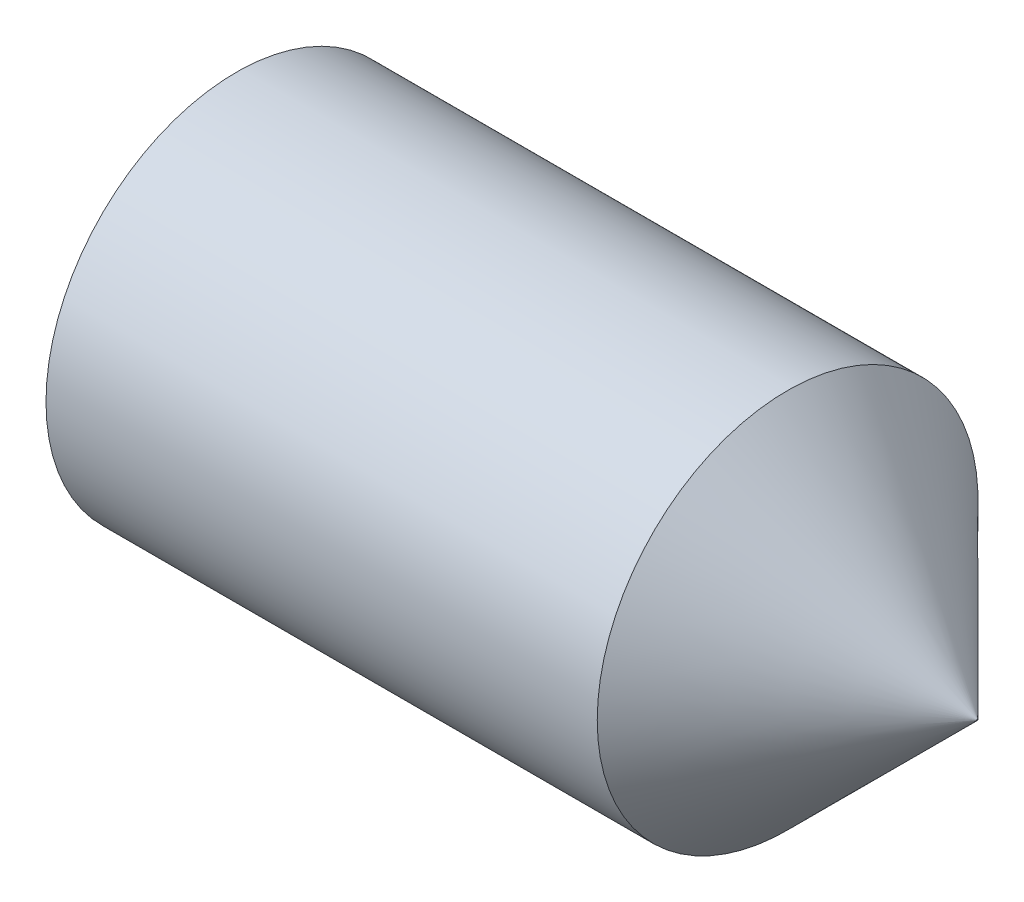
ISO-10303-21;
HEADER;
FILE_DESCRIPTION(('STEP AP214'),'2;1');
FILE_NAME('part.step','',(''),(''),'','','');
FILE_SCHEMA(('AUTOMOTIVE_DESIGN { 1 0 10303 214 1 1 1 1 }'));
ENDSEC;
DATA;
#1=APPLICATION_CONTEXT('core data for automotive mechanical design processes');
#2=APPLICATION_PROTOCOL_DEFINITION('international standard','automotive_design',2000,#1);
#3=PRODUCT_CONTEXT('',#1,'mechanical');
#4=PRODUCT('Part','Part','',(#3));
#5=PRODUCT_RELATED_PRODUCT_CATEGORY('part','',(#4));
#6=PRODUCT_DEFINITION_FORMATION('','',#4);
#7=PRODUCT_DEFINITION_CONTEXT('part definition',#1,'design');
#8=PRODUCT_DEFINITION('design','',#6,#7);
#9=PRODUCT_DEFINITION_SHAPE('','',#8);
#10=(LENGTH_UNIT() NAMED_UNIT(*) SI_UNIT(.MILLI.,.METRE.));
#11=(NAMED_UNIT(*) PLANE_ANGLE_UNIT() SI_UNIT($,.RADIAN.));
#12=(NAMED_UNIT(*) SI_UNIT($,.STERADIAN.) SOLID_ANGLE_UNIT());
#13=UNCERTAINTY_MEASURE_WITH_UNIT(LENGTH_MEASURE(1.E-05),#10,'distance_accuracy_value','');
#14=(GEOMETRIC_REPRESENTATION_CONTEXT(3) GLOBAL_UNCERTAINTY_ASSIGNED_CONTEXT((#13)) GLOBAL_UNIT_ASSIGNED_CONTEXT((#10,
#11,#12)) REPRESENTATION_CONTEXT('',''));
#15=CARTESIAN_POINT('',(0.,0.,0.));
#16=DIRECTION('',(0.,0.,1.));
#17=DIRECTION('',(1.,0.,0.));
#18=AXIS2_PLACEMENT_3D('',#15,#16,#17);
#19=CARTESIAN_POINT('',(0.,0.,0.));
#20=DIRECTION('',(-1.,0.,0.));
#21=DIRECTION('',(0.,0.,1.));
#22=AXIS2_PLACEMENT_3D('',#19,#20,#21);
#23=PLANE('',#22);
#24=CARTESIAN_POINT('',(0.,0.,0.));
#25=DIRECTION('',(-1.,0.,0.));
#26=DIRECTION('',(0.,0.,1.));
#27=AXIS2_PLACEMENT_3D('',#24,#25,#26);
#28=CIRCLE('',#27,1.2195);
#29=CARTESIAN_POINT('',(0.,0.,1.2195));
#30=VERTEX_POINT('',#29);
#31=EDGE_CURVE('E138',#30,#30,#28,.T.);
#32=ORIENTED_EDGE('',*,*,#31,.T.);
#33=EDGE_LOOP('',(#32));
#34=FACE_BOUND('',#33,.T.);
#35=DIRECTION('',(0.,0.,-1.));
#36=VECTOR('',#35,1.);
#37=CARTESIAN_POINT('',(0.,0.750000000000003,0.433012701892217));
#38=LINE('',#37,#36);
#39=CARTESIAN_POINT('',(0.,0.750000000000003,0.433012701892217));
#40=VERTEX_POINT('',#39);
#41=CARTESIAN_POINT('',(0.,0.750000000000003,-0.433012701892221));
#42=VERTEX_POINT('',#41);
#43=EDGE_CURVE('E129',#40,#42,#38,.T.);
#44=ORIENTED_EDGE('',*,*,#43,.F.);
#45=DIRECTION('',(0.,-0.866025403784438,0.5));
#46=VECTOR('',#45,1.);
#47=CARTESIAN_POINT('',(0.,0.750000000000003,0.433012701892217));
#48=LINE('',#47,#46);
#49=CARTESIAN_POINT('',(0.,0.,0.866025403784437));
#50=VERTEX_POINT('',#49);
#51=EDGE_CURVE('E51',#40,#50,#48,.T.);
#52=ORIENTED_EDGE('',*,*,#51,.T.);
#53=DIRECTION('',(0.,0.866025403784439,0.5));
#54=VECTOR('',#53,1.);
#55=CARTESIAN_POINT('',(0.,-0.749999999999996,0.433012701892218));
#56=LINE('',#55,#54);
#57=CARTESIAN_POINT('',(0.,-0.749999999999996,0.433012701892218));
#58=VERTEX_POINT('',#57);
#59=EDGE_CURVE('E120',#58,#50,#56,.T.);
#60=ORIENTED_EDGE('',*,*,#59,.F.);
#61=DIRECTION('',(0.,0.,-1.));
#62=VECTOR('',#61,1.);
#63=CARTESIAN_POINT('',(0.,-0.749999999999996,0.433012701892218));
#64=LINE('',#63,#62);
#65=CARTESIAN_POINT('',(0.,-0.749999999999996,-0.433012701892221));
#66=VERTEX_POINT('',#65);
#67=EDGE_CURVE('E123',#58,#66,#64,.T.);
#68=ORIENTED_EDGE('',*,*,#67,.T.);
#69=DIRECTION('',(0.,0.866025403784438,-0.500000000000001));
#70=VECTOR('',#69,1.);
#71=CARTESIAN_POINT('',(0.,-0.749999999999996,-0.433012701892221));
#72=LINE('',#71,#70);
#73=CARTESIAN_POINT('',(0.,0.,-0.866025403784441));
#74=VERTEX_POINT('',#73);
#75=EDGE_CURVE('E126',#66,#74,#72,.T.);
#76=ORIENTED_EDGE('',*,*,#75,.T.);
#77=DIRECTION('',(0.,-0.866025403784438,-0.5));
#78=VECTOR('',#77,1.);
#79=CARTESIAN_POINT('',(0.,0.750000000000003,-0.433012701892221));
#80=LINE('',#79,#78);
#81=EDGE_CURVE('E109',#42,#74,#80,.T.);
#82=ORIENTED_EDGE('',*,*,#81,.F.);
#83=EDGE_LOOP('',(#44,#52,#60,#68,#76,#82));
#84=FACE_BOUND('',#83,.T.);
#85=ADVANCED_FACE('F36',(#34,#84),#23,.T.);
#86=CARTESIAN_POINT('',(6.,0.005,0.));
#87=DIRECTION('',(1.,0.,0.));
#88=DIRECTION('',(0.,0.,-1.));
#89=AXIS2_PLACEMENT_3D('',#86,#87,#88);
#90=PLANE('',#89);
#91=CARTESIAN_POINT('',(6.,0.,0.));
#92=DIRECTION('',(-1.,0.,0.));
#93=DIRECTION('',(0.,0.,1.));
#94=AXIS2_PLACEMENT_3D('',#91,#92,#93);
#95=CIRCLE('',#94,0.005);
#96=CARTESIAN_POINT('',(6.,0.,0.005));
#97=VERTEX_POINT('',#96);
#98=EDGE_CURVE('E11',#97,#97,#95,.T.);
#99=ORIENTED_EDGE('',*,*,#98,.F.);
#100=EDGE_LOOP('',(#99));
#101=FACE_BOUND('',#100,.T.);
#102=ADVANCED_FACE('F38',(#101),#90,.T.);
#103=CARTESIAN_POINT('',(4.50499999999999,0.,0.));
#104=DIRECTION('',(-1.,0.,0.));
#105=DIRECTION('',(0.,0.,1.));
#106=AXIS2_PLACEMENT_3D('',#103,#104,#105);
#107=CONICAL_SURFACE('',#106,1.5,0.785398163397446);
#108=ORIENTED_EDGE('',*,*,#98,.T.);
#109=EDGE_LOOP('',(#108));
#110=FACE_BOUND('',#109,.T.);
#111=CARTESIAN_POINT('',(4.50499999999999,0.,0.));
#112=DIRECTION('',(-1.,0.,0.));
#113=DIRECTION('',(0.,0.,1.));
#114=AXIS2_PLACEMENT_3D('',#111,#112,#113);
#115=CIRCLE('',#114,1.5);
#116=CARTESIAN_POINT('',(4.50499999999999,0.,1.5));
#117=VERTEX_POINT('',#116);
#118=EDGE_CURVE('E44',#117,#117,#115,.T.);
#119=ORIENTED_EDGE('',*,*,#118,.F.);
#120=EDGE_LOOP('',(#119));
#121=FACE_BOUND('',#120,.T.);
#122=ADVANCED_FACE('F149',(#110,#121),#107,.T.);
#123=CARTESIAN_POINT('',(-12.7,0.,0.));
#124=DIRECTION('',(-1.,0.,0.));
#125=DIRECTION('',(0.,0.,1.));
#126=AXIS2_PLACEMENT_3D('',#123,#124,#125);
#127=CYLINDRICAL_SURFACE('',#126,1.5);
#128=ORIENTED_EDGE('',*,*,#118,.T.);
#129=EDGE_LOOP('',(#128));
#130=FACE_BOUND('',#129,.T.);
#131=CARTESIAN_POINT('',(0.161946750507689,0.,0.));
#132=DIRECTION('',(-1.,0.,0.));
#133=DIRECTION('',(0.,0.,1.));
#134=AXIS2_PLACEMENT_3D('',#131,#132,#133);
#135=CIRCLE('',#134,1.5);
#136=CARTESIAN_POINT('',(0.161946750507689,0.,1.5));
#137=VERTEX_POINT('',#136);
#138=EDGE_CURVE('E141',#137,#137,#135,.T.);
#139=ORIENTED_EDGE('',*,*,#138,.F.);
#140=EDGE_LOOP('',(#139));
#141=FACE_BOUND('',#140,.T.);
#142=ADVANCED_FACE('F146',(#130,#141),#127,.T.);
#143=CARTESIAN_POINT('',(0.,0.,0.));
#144=DIRECTION('',(1.,0.,0.));
#145=DIRECTION('',(0.,0.,-1.));
#146=AXIS2_PLACEMENT_3D('',#143,#144,#145);
#147=CONICAL_SURFACE('',#146,1.2195,1.0471975511966);
#148=ORIENTED_EDGE('',*,*,#138,.T.);
#149=EDGE_LOOP('',(#148));
#150=FACE_BOUND('',#149,.T.);
#151=ORIENTED_EDGE('',*,*,#31,.F.);
#152=EDGE_LOOP('',(#151));
#153=FACE_BOUND('',#152,.T.);
#154=ADVANCED_FACE('F156',(#150,#153),#147,.T.);
#155=CARTESIAN_POINT('',(2.,0.750000000000003,0.433012701892217));
#156=DIRECTION('',(0.,-0.5,-0.866025403784438));
#157=DIRECTION('',(0.,0.866025403784438,-0.5));
#158=AXIS2_PLACEMENT_3D('',#155,#156,#157);
#159=PLANE('',#158);
#160=ORIENTED_EDGE('',*,*,#51,.F.);
#161=DIRECTION('',(-1.,0.,0.));
#162=VECTOR('',#161,1.);
#163=CARTESIAN_POINT('',(2.,0.750000000000003,0.433012701892217));
#164=LINE('',#163,#162);
#165=CARTESIAN_POINT('',(2.,0.750000000000003,0.433012701892217));
#166=VERTEX_POINT('',#165);
#167=EDGE_CURVE('E56',#166,#40,#164,.T.);
#168=ORIENTED_EDGE('',*,*,#167,.F.);
#169=DIRECTION('',(0.,-0.866025403784438,0.5));
#170=VECTOR('',#169,1.);
#171=CARTESIAN_POINT('',(2.,0.750000000000003,0.433012701892217));
#172=LINE('',#171,#170);
#173=CARTESIAN_POINT('',(2.,0.,0.866025403784437));
#174=VERTEX_POINT('',#173);
#175=EDGE_CURVE('E83',#166,#174,#172,.T.);
#176=ORIENTED_EDGE('',*,*,#175,.T.);
#177=DIRECTION('',(-1.,0.,0.));
#178=VECTOR('',#177,1.);
#179=CARTESIAN_POINT('',(2.,0.,0.866025403784437));
#180=LINE('',#179,#178);
#181=EDGE_CURVE('E136',#174,#50,#180,.T.);
#182=ORIENTED_EDGE('',*,*,#181,.T.);
#183=EDGE_LOOP('',(#160,#168,#176,#182));
#184=FACE_BOUND('',#183,.T.);
#185=ADVANCED_FACE('F167',(#184),#159,.T.);
#186=CARTESIAN_POINT('',(2.,-0.749999999999996,0.433012701892218));
#187=DIRECTION('',(0.,-0.5,0.866025403784439));
#188=DIRECTION('',(0.,-0.866025403784439,-0.5));
#189=AXIS2_PLACEMENT_3D('',#186,#187,#188);
#190=PLANE('',#189);
#191=ORIENTED_EDGE('',*,*,#59,.T.);
#192=ORIENTED_EDGE('',*,*,#181,.F.);
#193=DIRECTION('',(0.,0.866025403784439,0.5));
#194=VECTOR('',#193,1.);
#195=CARTESIAN_POINT('',(2.,-0.749999999999996,0.433012701892218));
#196=LINE('',#195,#194);
#197=CARTESIAN_POINT('',(2.,-0.749999999999996,0.433012701892218));
#198=VERTEX_POINT('',#197);
#199=EDGE_CURVE('E267',#198,#174,#196,.T.);
#200=ORIENTED_EDGE('',*,*,#199,.F.);
#201=DIRECTION('',(-1.,0.,0.));
#202=VECTOR('',#201,1.);
#203=CARTESIAN_POINT('',(2.,-0.749999999999996,0.433012701892218));
#204=LINE('',#203,#202);
#205=EDGE_CURVE('E134',#198,#58,#204,.T.);
#206=ORIENTED_EDGE('',*,*,#205,.T.);
#207=EDGE_LOOP('',(#191,#192,#200,#206));
#208=FACE_BOUND('',#207,.T.);
#209=ADVANCED_FACE('F174',(#208),#190,.F.);
#210=CARTESIAN_POINT('',(2.,-0.749999999999996,0.433012701892218));
#211=DIRECTION('',(0.,1.,0.));
#212=DIRECTION('',(0.,0.,1.));
#213=AXIS2_PLACEMENT_3D('',#210,#211,#212);
#214=PLANE('',#213);
#215=ORIENTED_EDGE('',*,*,#67,.F.);
#216=ORIENTED_EDGE('',*,*,#205,.F.);
#217=DIRECTION('',(0.,0.,-1.));
#218=VECTOR('',#217,1.);
#219=CARTESIAN_POINT('',(2.,-0.749999999999996,0.433012701892218));
#220=LINE('',#219,#218);
#221=CARTESIAN_POINT('',(2.,-0.749999999999996,-0.433012701892221));
#222=VERTEX_POINT('',#221);
#223=EDGE_CURVE('E104',#198,#222,#220,.T.);
#224=ORIENTED_EDGE('',*,*,#223,.T.);
#225=DIRECTION('',(-1.,0.,0.));
#226=VECTOR('',#225,1.);
#227=CARTESIAN_POINT('',(2.,-0.749999999999996,-0.433012701892221));
#228=LINE('',#227,#226);
#229=EDGE_CURVE('E99',#222,#66,#228,.T.);
#230=ORIENTED_EDGE('',*,*,#229,.T.);
#231=EDGE_LOOP('',(#215,#216,#224,#230));
#232=FACE_BOUND('',#231,.T.);
#233=ADVANCED_FACE('F181',(#232),#214,.T.);
#234=CARTESIAN_POINT('',(2.,-0.749999999999996,-0.433012701892221));
#235=DIRECTION('',(0.,0.500000000000001,0.866025403784438));
#236=DIRECTION('',(0.,-0.866025403784438,0.500000000000001));
#237=AXIS2_PLACEMENT_3D('',#234,#235,#236);
#238=PLANE('',#237);
#239=ORIENTED_EDGE('',*,*,#75,.F.);
#240=ORIENTED_EDGE('',*,*,#229,.F.);
#241=DIRECTION('',(0.,0.866025403784438,-0.500000000000001));
#242=VECTOR('',#241,1.);
#243=CARTESIAN_POINT('',(2.,-0.749999999999996,-0.433012701892221));
#244=LINE('',#243,#242);
#245=CARTESIAN_POINT('',(2.,0.,-0.866025403784441));
#246=VERTEX_POINT('',#245);
#247=EDGE_CURVE('E94',#222,#246,#244,.T.);
#248=ORIENTED_EDGE('',*,*,#247,.T.);
#249=DIRECTION('',(-1.,0.,0.));
#250=VECTOR('',#249,1.);
#251=CARTESIAN_POINT('',(2.,0.,-0.866025403784441));
#252=LINE('',#251,#250);
#253=EDGE_CURVE('E98',#246,#74,#252,.T.);
#254=ORIENTED_EDGE('',*,*,#253,.T.);
#255=EDGE_LOOP('',(#239,#240,#248,#254));
#256=FACE_BOUND('',#255,.T.);
#257=ADVANCED_FACE('F97',(#256),#238,.T.);
#258=CARTESIAN_POINT('',(2.,0.750000000000003,-0.433012701892221));
#259=DIRECTION('',(0.,0.5,-0.866025403784439));
#260=DIRECTION('',(0.,0.866025403784439,0.5));
#261=AXIS2_PLACEMENT_3D('',#258,#259,#260);
#262=PLANE('',#261);
#263=ORIENTED_EDGE('',*,*,#81,.T.);
#264=ORIENTED_EDGE('',*,*,#253,.F.);
#265=DIRECTION('',(0.,-0.866025403784438,-0.5));
#266=VECTOR('',#265,1.);
#267=CARTESIAN_POINT('',(2.,0.750000000000003,-0.433012701892221));
#268=LINE('',#267,#266);
#269=CARTESIAN_POINT('',(2.,0.750000000000003,-0.433012701892221));
#270=VERTEX_POINT('',#269);
#271=EDGE_CURVE('E103',#270,#246,#268,.T.);
#272=ORIENTED_EDGE('',*,*,#271,.F.);
#273=DIRECTION('',(-1.,0.,0.));
#274=VECTOR('',#273,1.);
#275=CARTESIAN_POINT('',(2.,0.750000000000003,-0.433012701892221));
#276=LINE('',#275,#274);
#277=EDGE_CURVE('E79',#270,#42,#276,.T.);
#278=ORIENTED_EDGE('',*,*,#277,.T.);
#279=EDGE_LOOP('',(#263,#264,#272,#278));
#280=FACE_BOUND('',#279,.T.);
#281=ADVANCED_FACE('F106',(#280),#262,.F.);
#282=CARTESIAN_POINT('',(2.,0.750000000000003,0.433012701892217));
#283=DIRECTION('',(0.,1.,0.));
#284=DIRECTION('',(0.,0.,1.));
#285=AXIS2_PLACEMENT_3D('',#282,#283,#284);
#286=PLANE('',#285);
#287=ORIENTED_EDGE('',*,*,#43,.T.);
#288=ORIENTED_EDGE('',*,*,#277,.F.);
#289=DIRECTION('',(0.,0.,-1.));
#290=VECTOR('',#289,1.);
#291=CARTESIAN_POINT('',(2.,0.750000000000003,0.433012701892217));
#292=LINE('',#291,#290);
#293=EDGE_CURVE('E114',#166,#270,#292,.T.);
#294=ORIENTED_EDGE('',*,*,#293,.F.);
#295=ORIENTED_EDGE('',*,*,#167,.T.);
#296=EDGE_LOOP('',(#287,#288,#294,#295));
#297=FACE_BOUND('',#296,.T.);
#298=ADVANCED_FACE('F193',(#297),#286,.F.);
#299=CARTESIAN_POINT('',(2.,1.5,0.));
#300=DIRECTION('',(1.,0.,0.));
#301=DIRECTION('',(0.,0.,-1.));
#302=AXIS2_PLACEMENT_3D('',#299,#300,#301);
#303=PLANE('',#302);
#304=ORIENTED_EDGE('',*,*,#175,.F.);
#305=ORIENTED_EDGE('',*,*,#293,.T.);
#306=ORIENTED_EDGE('',*,*,#271,.T.);
#307=ORIENTED_EDGE('',*,*,#247,.F.);
#308=ORIENTED_EDGE('',*,*,#223,.F.);
#309=ORIENTED_EDGE('',*,*,#199,.T.);
#310=EDGE_LOOP('',(#304,#305,#306,#307,#308,#309));
#311=FACE_BOUND('',#310,.T.);
#312=ADVANCED_FACE('F112',(#311),#303,.F.);
#313=CLOSED_SHELL('',(#85,#102,#122,#142,#154,#185,#209,#233,#257,#281,#298,#312));
#314=MANIFOLD_SOLID_BREP('B2',#313);
#315=ADVANCED_BREP_SHAPE_REPRESENTATION('',(#18,#314),#14);
#316=SHAPE_DEFINITION_REPRESENTATION(#9,#315);
ENDSEC;
END-ISO-10303-21;
